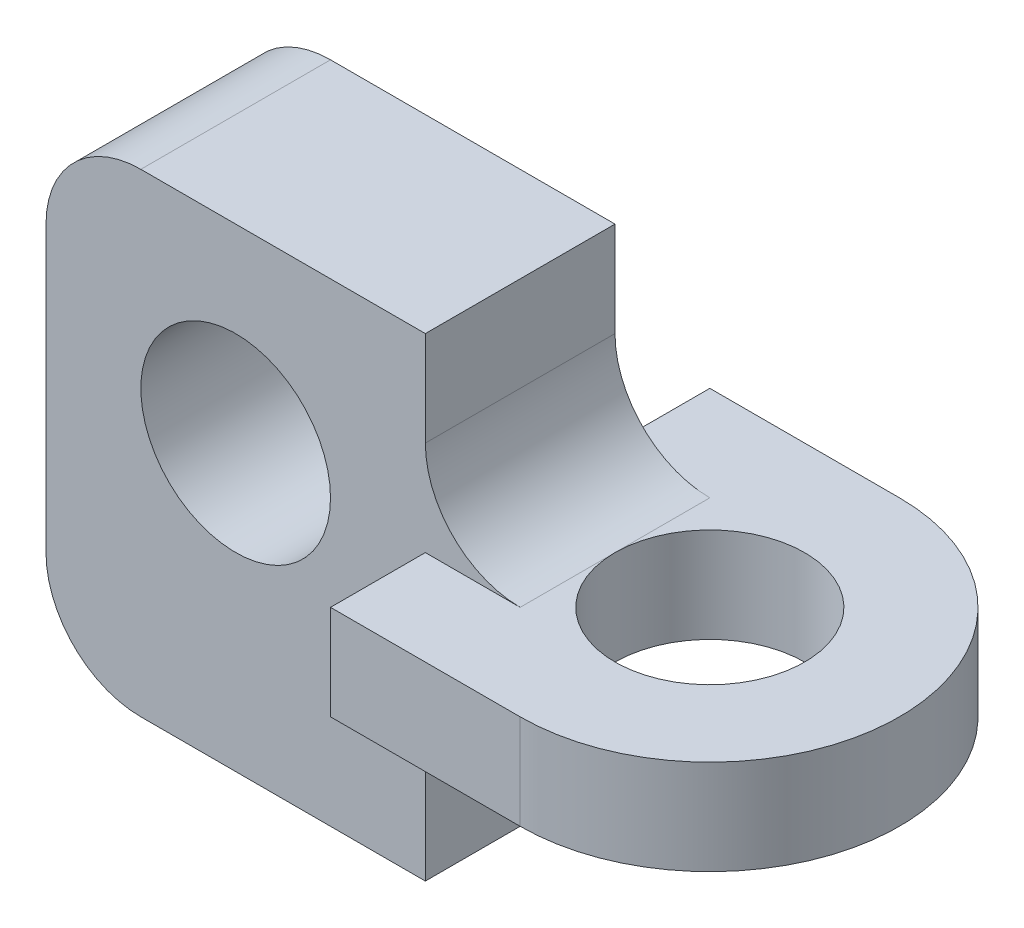
ISO-10303-21;
HEADER;
FILE_DESCRIPTION(('STEP AP214'),'2;1');
FILE_NAME('part.step','',(''),(''),'','','');
FILE_SCHEMA(('AUTOMOTIVE_DESIGN { 1 0 10303 214 1 1 1 1 }'));
ENDSEC;
DATA;
#1=APPLICATION_CONTEXT('core data for automotive mechanical design processes');
#2=APPLICATION_PROTOCOL_DEFINITION('international standard','automotive_design',2000,#1);
#3=PRODUCT_CONTEXT('',#1,'mechanical');
#4=PRODUCT('Part','Part','',(#3));
#5=PRODUCT_RELATED_PRODUCT_CATEGORY('part','',(#4));
#6=PRODUCT_DEFINITION_FORMATION('','',#4);
#7=PRODUCT_DEFINITION_CONTEXT('part definition',#1,'design');
#8=PRODUCT_DEFINITION('design','',#6,#7);
#9=PRODUCT_DEFINITION_SHAPE('','',#8);
#10=(LENGTH_UNIT() NAMED_UNIT(*) SI_UNIT(.MILLI.,.METRE.));
#11=(NAMED_UNIT(*) PLANE_ANGLE_UNIT() SI_UNIT($,.RADIAN.));
#12=(NAMED_UNIT(*) SI_UNIT($,.STERADIAN.) SOLID_ANGLE_UNIT());
#13=UNCERTAINTY_MEASURE_WITH_UNIT(LENGTH_MEASURE(1.E-05),#10,'distance_accuracy_value','');
#14=(GEOMETRIC_REPRESENTATION_CONTEXT(3) GLOBAL_UNCERTAINTY_ASSIGNED_CONTEXT((#13)) GLOBAL_UNIT_ASSIGNED_CONTEXT((#10,
#11,#12)) REPRESENTATION_CONTEXT('',''));
#15=CARTESIAN_POINT('',(0.,0.,0.));
#16=DIRECTION('',(0.,0.,1.));
#17=DIRECTION('',(1.,0.,0.));
#18=AXIS2_PLACEMENT_3D('',#15,#16,#17);
#19=CARTESIAN_POINT('',(-30.,15.,10.));
#20=DIRECTION('',(0.,0.,1.));
#21=DIRECTION('',(1.,0.,0.));
#22=AXIS2_PLACEMENT_3D('',#19,#20,#21);
#23=PLANE('',#22);
#24=DIRECTION('',(-1.,0.,0.));
#25=VECTOR('',#24,1.);
#26=CARTESIAN_POINT('',(-30.,5.,10.));
#27=LINE('',#26,#25);
#28=CARTESIAN_POINT('',(10.,5.,10.));
#29=VERTEX_POINT('',#28);
#30=CARTESIAN_POINT('',(0.,5.,10.));
#31=VERTEX_POINT('',#30);
#32=EDGE_CURVE('E178',#29,#31,#27,.T.);
#33=ORIENTED_EDGE('',*,*,#32,.F.);
#34=CARTESIAN_POINT('',(10.,15.,10.));
#35=DIRECTION('',(0.,0.,1.));
#36=DIRECTION('',(1.,0.,0.));
#37=AXIS2_PLACEMENT_3D('',#34,#35,#36);
#38=CIRCLE('',#37,10.);
#39=CARTESIAN_POINT('',(0.,15.,10.));
#40=VERTEX_POINT('',#39);
#41=EDGE_CURVE('E40',#29,#40,#38,.F.);
#42=ORIENTED_EDGE('',*,*,#41,.T.);
#43=DIRECTION('',(0.,1.,0.));
#44=VECTOR('',#43,1.);
#45=CARTESIAN_POINT('',(0.,25.,10.));
#46=LINE('',#45,#44);
#47=CARTESIAN_POINT('',(0.,25.,10.));
#48=VERTEX_POINT('',#47);
#49=EDGE_CURVE('E210',#40,#48,#46,.T.);
#50=ORIENTED_EDGE('',*,*,#49,.T.);
#51=DIRECTION('',(-1.,0.,0.));
#52=VECTOR('',#51,1.);
#53=CARTESIAN_POINT('',(-29.9999999999999,25.,10.));
#54=LINE('',#53,#52);
#55=CARTESIAN_POINT('',(-29.9999999999999,25.,10.));
#56=VERTEX_POINT('',#55);
#57=EDGE_CURVE('E212',#48,#56,#54,.T.);
#58=ORIENTED_EDGE('',*,*,#57,.T.);
#59=CARTESIAN_POINT('',(-30.,15.,10.));
#60=DIRECTION('',(0.,0.,1.));
#61=DIRECTION('',(1.,0.,0.));
#62=AXIS2_PLACEMENT_3D('',#59,#60,#61);
#63=CIRCLE('',#62,10.);
#64=CARTESIAN_POINT('',(-40.,14.9999999999999,10.));
#65=VERTEX_POINT('',#64);
#66=EDGE_CURVE('E214',#56,#65,#63,.T.);
#67=ORIENTED_EDGE('',*,*,#66,.T.);
#68=DIRECTION('',(0.,-1.,0.));
#69=VECTOR('',#68,1.);
#70=CARTESIAN_POINT('',(-40.,14.9999999999999,10.));
#71=LINE('',#70,#69);
#72=CARTESIAN_POINT('',(-40.,-14.9999999999999,10.));
#73=VERTEX_POINT('',#72);
#74=EDGE_CURVE('E216',#65,#73,#71,.T.);
#75=ORIENTED_EDGE('',*,*,#74,.T.);
#76=CARTESIAN_POINT('',(-30.,-15.,10.));
#77=DIRECTION('',(0.,0.,1.));
#78=DIRECTION('',(1.,0.,0.));
#79=AXIS2_PLACEMENT_3D('',#76,#77,#78);
#80=CIRCLE('',#79,10.);
#81=CARTESIAN_POINT('',(-29.9999999999999,-25.,10.));
#82=VERTEX_POINT('',#81);
#83=EDGE_CURVE('E218',#73,#82,#80,.T.);
#84=ORIENTED_EDGE('',*,*,#83,.T.);
#85=DIRECTION('',(1.,0.,0.));
#86=VECTOR('',#85,1.);
#87=CARTESIAN_POINT('',(-29.9999999999999,-25.,10.));
#88=LINE('',#87,#86);
#89=CARTESIAN_POINT('',(0.,-25.,10.));
#90=VERTEX_POINT('',#89);
#91=EDGE_CURVE('E203',#82,#90,#88,.T.);
#92=ORIENTED_EDGE('',*,*,#91,.T.);
#93=DIRECTION('',(0.,1.,0.));
#94=VECTOR('',#93,1.);
#95=CARTESIAN_POINT('',(0.,-5.,10.));
#96=LINE('',#95,#94);
#97=CARTESIAN_POINT('',(0.,-15.,10.));
#98=VERTEX_POINT('',#97);
#99=EDGE_CURVE('E206',#90,#98,#96,.T.);
#100=ORIENTED_EDGE('',*,*,#99,.T.);
#101=CARTESIAN_POINT('',(10.,-15.,10.));
#102=DIRECTION('',(0.,0.,1.));
#103=DIRECTION('',(1.,0.,0.));
#104=AXIS2_PLACEMENT_3D('',#101,#102,#103);
#105=CIRCLE('',#104,10.);
#106=CARTESIAN_POINT('',(10.,-5.,10.));
#107=VERTEX_POINT('',#106);
#108=EDGE_CURVE('E265',#98,#107,#105,.F.);
#109=ORIENTED_EDGE('',*,*,#108,.T.);
#110=DIRECTION('',(-1.,0.,0.));
#111=VECTOR('',#110,1.);
#112=CARTESIAN_POINT('',(-30.,-5.,10.));
#113=LINE('',#112,#111);
#114=CARTESIAN_POINT('',(0.,-5.,10.));
#115=VERTEX_POINT('',#114);
#116=EDGE_CURVE('E188',#107,#115,#113,.T.);
#117=ORIENTED_EDGE('',*,*,#116,.T.);
#118=DIRECTION('',(0.,1.,0.));
#119=VECTOR('',#118,1.);
#120=CARTESIAN_POINT('',(0.,15.,10.));
#121=LINE('',#120,#119);
#122=EDGE_CURVE('E193',#115,#31,#121,.T.);
#123=ORIENTED_EDGE('',*,*,#122,.T.);
#124=EDGE_LOOP('',(#33,#42,#50,#58,#67,#75,#84,#92,#100,#109,#117,#123));
#125=FACE_BOUND('',#124,.T.);
#126=CARTESIAN_POINT('',(-20.,5.,10.));
#127=DIRECTION('',(0.,0.,1.));
#128=DIRECTION('',(1.,0.,0.));
#129=AXIS2_PLACEMENT_3D('',#126,#127,#128);
#130=CIRCLE('',#129,10.);
#131=CARTESIAN_POINT('',(-9.99999999999999,5.,10.));
#132=VERTEX_POINT('',#131);
#133=EDGE_CURVE('E197',#132,#132,#130,.T.);
#134=ORIENTED_EDGE('',*,*,#133,.F.);
#135=EDGE_LOOP('',(#134));
#136=FACE_BOUND('',#135,.T.);
#137=ADVANCED_FACE('F32',(#125,#136),#23,.T.);
#138=CARTESIAN_POINT('',(-30.,15.,-10.));
#139=DIRECTION('',(0.,0.,1.));
#140=DIRECTION('',(1.,0.,0.));
#141=AXIS2_PLACEMENT_3D('',#138,#139,#140);
#142=PLANE('',#141);
#143=CARTESIAN_POINT('',(10.,15.,-10.));
#144=DIRECTION('',(0.,0.,1.));
#145=DIRECTION('',(1.,0.,0.));
#146=AXIS2_PLACEMENT_3D('',#143,#144,#145);
#147=CIRCLE('',#146,10.);
#148=CARTESIAN_POINT('',(0.,15.,-10.));
#149=VERTEX_POINT('',#148);
#150=CARTESIAN_POINT('',(10.,5.,-10.));
#151=VERTEX_POINT('',#150);
#152=EDGE_CURVE('E54',#149,#151,#147,.T.);
#153=ORIENTED_EDGE('',*,*,#152,.T.);
#154=DIRECTION('',(-1.,0.,0.));
#155=VECTOR('',#154,1.);
#156=CARTESIAN_POINT('',(-30.,5.,-10.));
#157=LINE('',#156,#155);
#158=CARTESIAN_POINT('',(0.,5.,-10.));
#159=VERTEX_POINT('',#158);
#160=EDGE_CURVE('E180',#151,#159,#157,.T.);
#161=ORIENTED_EDGE('',*,*,#160,.T.);
#162=DIRECTION('',(0.,1.,0.));
#163=VECTOR('',#162,1.);
#164=CARTESIAN_POINT('',(0.,15.,-10.));
#165=LINE('',#164,#163);
#166=CARTESIAN_POINT('',(0.,-5.,-10.));
#167=VERTEX_POINT('',#166);
#168=EDGE_CURVE('E11',#167,#159,#165,.T.);
#169=ORIENTED_EDGE('',*,*,#168,.F.);
#170=DIRECTION('',(-1.,0.,0.));
#171=VECTOR('',#170,1.);
#172=CARTESIAN_POINT('',(-30.,-5.,-10.));
#173=LINE('',#172,#171);
#174=CARTESIAN_POINT('',(10.,-5.,-10.));
#175=VERTEX_POINT('',#174);
#176=EDGE_CURVE('E191',#175,#167,#173,.T.);
#177=ORIENTED_EDGE('',*,*,#176,.F.);
#178=CARTESIAN_POINT('',(10.,-15.,-10.));
#179=DIRECTION('',(0.,0.,1.));
#180=DIRECTION('',(1.,0.,0.));
#181=AXIS2_PLACEMENT_3D('',#178,#179,#180);
#182=CIRCLE('',#181,10.);
#183=CARTESIAN_POINT('',(0.,-15.,-10.));
#184=VERTEX_POINT('',#183);
#185=EDGE_CURVE('E263',#175,#184,#182,.T.);
#186=ORIENTED_EDGE('',*,*,#185,.T.);
#187=DIRECTION('',(0.,1.,0.));
#188=VECTOR('',#187,1.);
#189=CARTESIAN_POINT('',(0.,-5.,-10.));
#190=LINE('',#189,#188);
#191=CARTESIAN_POINT('',(0.,-25.,-10.));
#192=VERTEX_POINT('',#191);
#193=EDGE_CURVE('E223',#192,#184,#190,.T.);
#194=ORIENTED_EDGE('',*,*,#193,.F.);
#195=DIRECTION('',(1.,0.,0.));
#196=VECTOR('',#195,1.);
#197=CARTESIAN_POINT('',(-29.9999999999999,-25.,-10.));
#198=LINE('',#197,#196);
#199=CARTESIAN_POINT('',(-29.9999999999999,-25.,-10.));
#200=VERTEX_POINT('',#199);
#201=EDGE_CURVE('E200',#200,#192,#198,.T.);
#202=ORIENTED_EDGE('',*,*,#201,.F.);
#203=CARTESIAN_POINT('',(-30.,-15.,-10.));
#204=DIRECTION('',(0.,0.,1.));
#205=DIRECTION('',(1.,0.,0.));
#206=AXIS2_PLACEMENT_3D('',#203,#204,#205);
#207=CIRCLE('',#206,10.);
#208=CARTESIAN_POINT('',(-40.,-14.9999999999999,-10.));
#209=VERTEX_POINT('',#208);
#210=EDGE_CURVE('E207',#209,#200,#207,.T.);
#211=ORIENTED_EDGE('',*,*,#210,.F.);
#212=DIRECTION('',(0.,-1.,0.));
#213=VECTOR('',#212,1.);
#214=CARTESIAN_POINT('',(-40.,14.9999999999999,-10.));
#215=LINE('',#214,#213);
#216=CARTESIAN_POINT('',(-40.,14.9999999999999,-10.));
#217=VERTEX_POINT('',#216);
#218=EDGE_CURVE('E232',#217,#209,#215,.T.);
#219=ORIENTED_EDGE('',*,*,#218,.F.);
#220=CARTESIAN_POINT('',(-30.,15.,-10.));
#221=DIRECTION('',(0.,0.,1.));
#222=DIRECTION('',(1.,0.,0.));
#223=AXIS2_PLACEMENT_3D('',#220,#221,#222);
#224=CIRCLE('',#223,10.);
#225=CARTESIAN_POINT('',(-29.9999999999999,25.,-10.));
#226=VERTEX_POINT('',#225);
#227=EDGE_CURVE('E230',#226,#217,#224,.T.);
#228=ORIENTED_EDGE('',*,*,#227,.F.);
#229=DIRECTION('',(-1.,0.,0.));
#230=VECTOR('',#229,1.);
#231=CARTESIAN_POINT('',(-29.9999999999999,25.,-10.));
#232=LINE('',#231,#230);
#233=CARTESIAN_POINT('',(0.,25.,-10.));
#234=VERTEX_POINT('',#233);
#235=EDGE_CURVE('E228',#234,#226,#232,.T.);
#236=ORIENTED_EDGE('',*,*,#235,.F.);
#237=DIRECTION('',(0.,1.,0.));
#238=VECTOR('',#237,1.);
#239=CARTESIAN_POINT('',(0.,25.,-10.));
#240=LINE('',#239,#238);
#241=EDGE_CURVE('E226',#149,#234,#240,.T.);
#242=ORIENTED_EDGE('',*,*,#241,.F.);
#243=EDGE_LOOP('',(#153,#161,#169,#177,#186,#194,#202,#211,#219,#228,#236,#242));
#244=FACE_BOUND('',#243,.T.);
#245=CARTESIAN_POINT('',(-20.,5.,-10.));
#246=DIRECTION('',(0.,0.,1.));
#247=DIRECTION('',(1.,0.,0.));
#248=AXIS2_PLACEMENT_3D('',#245,#246,#247);
#249=CIRCLE('',#248,10.);
#250=CARTESIAN_POINT('',(-9.99999999999999,5.,-10.));
#251=VERTEX_POINT('',#250);
#252=EDGE_CURVE('E196',#251,#251,#249,.T.);
#253=ORIENTED_EDGE('',*,*,#252,.T.);
#254=EDGE_LOOP('',(#253));
#255=FACE_BOUND('',#254,.T.);
#256=ADVANCED_FACE('F270',(#244,#255),#142,.F.);
#257=CARTESIAN_POINT('',(-29.9999999999999,-25.,10.));
#258=DIRECTION('',(0.,1.,0.));
#259=DIRECTION('',(0.,0.,1.));
#260=AXIS2_PLACEMENT_3D('',#257,#258,#259);
#261=PLANE('',#260);
#262=ORIENTED_EDGE('',*,*,#201,.T.);
#263=DIRECTION('',(0.,0.,-1.));
#264=VECTOR('',#263,1.);
#265=CARTESIAN_POINT('',(0.,-25.,10.));
#266=LINE('',#265,#264);
#267=EDGE_CURVE('E256',#90,#192,#266,.T.);
#268=ORIENTED_EDGE('',*,*,#267,.F.);
#269=ORIENTED_EDGE('',*,*,#91,.F.);
#270=DIRECTION('',(0.,0.,-1.));
#271=VECTOR('',#270,1.);
#272=CARTESIAN_POINT('',(-29.9999999999999,-25.,10.));
#273=LINE('',#272,#271);
#274=EDGE_CURVE('E220',#82,#200,#273,.T.);
#275=ORIENTED_EDGE('',*,*,#274,.T.);
#276=EDGE_LOOP('',(#262,#268,#269,#275));
#277=FACE_BOUND('',#276,.T.);
#278=ADVANCED_FACE('F334',(#277),#261,.F.);
#279=CARTESIAN_POINT('',(0.,-5.,10.));
#280=DIRECTION('',(-1.,0.,0.));
#281=DIRECTION('',(0.,-1.,0.));
#282=AXIS2_PLACEMENT_3D('',#279,#280,#281);
#283=PLANE('',#282);
#284=ORIENTED_EDGE('',*,*,#193,.T.);
#285=DIRECTION('',(0.,0.,-1.));
#286=VECTOR('',#285,1.);
#287=CARTESIAN_POINT('',(0.,-15.,10.));
#288=LINE('',#287,#286);
#289=EDGE_CURVE('E259',#184,#98,#288,.F.);
#290=ORIENTED_EDGE('',*,*,#289,.T.);
#291=ORIENTED_EDGE('',*,*,#99,.F.);
#292=ORIENTED_EDGE('',*,*,#267,.T.);
#293=EDGE_LOOP('',(#284,#290,#291,#292));
#294=FACE_BOUND('',#293,.T.);
#295=ADVANCED_FACE('F330',(#294),#283,.F.);
#296=CARTESIAN_POINT('',(0.,25.,10.));
#297=DIRECTION('',(-1.,0.,0.));
#298=DIRECTION('',(0.,-1.,0.));
#299=AXIS2_PLACEMENT_3D('',#296,#297,#298);
#300=PLANE('',#299);
#301=ORIENTED_EDGE('',*,*,#49,.F.);
#302=DIRECTION('',(0.,0.,-1.));
#303=VECTOR('',#302,1.);
#304=CARTESIAN_POINT('',(0.,15.,-10.));
#305=LINE('',#304,#303);
#306=EDGE_CURVE('E261',#40,#149,#305,.T.);
#307=ORIENTED_EDGE('',*,*,#306,.T.);
#308=ORIENTED_EDGE('',*,*,#241,.T.);
#309=DIRECTION('',(0.,0.,-1.));
#310=VECTOR('',#309,1.);
#311=CARTESIAN_POINT('',(0.,25.,10.));
#312=LINE('',#311,#310);
#313=EDGE_CURVE('E246',#48,#234,#312,.T.);
#314=ORIENTED_EDGE('',*,*,#313,.F.);
#315=EDGE_LOOP('',(#301,#307,#308,#314));
#316=FACE_BOUND('',#315,.T.);
#317=ADVANCED_FACE('F277',(#316),#300,.F.);
#318=CARTESIAN_POINT('',(-29.9999999999999,25.,10.));
#319=DIRECTION('',(0.,-1.,0.));
#320=DIRECTION('',(0.,0.,-1.));
#321=AXIS2_PLACEMENT_3D('',#318,#319,#320);
#322=PLANE('',#321);
#323=ORIENTED_EDGE('',*,*,#235,.T.);
#324=DIRECTION('',(0.,0.,-1.));
#325=VECTOR('',#324,1.);
#326=CARTESIAN_POINT('',(-29.9999999999999,25.,10.));
#327=LINE('',#326,#325);
#328=EDGE_CURVE('E243',#56,#226,#327,.T.);
#329=ORIENTED_EDGE('',*,*,#328,.F.);
#330=ORIENTED_EDGE('',*,*,#57,.F.);
#331=ORIENTED_EDGE('',*,*,#313,.T.);
#332=EDGE_LOOP('',(#323,#329,#330,#331));
#333=FACE_BOUND('',#332,.T.);
#334=ADVANCED_FACE('F280',(#333),#322,.F.);
#335=CARTESIAN_POINT('',(-30.,15.,10.));
#336=DIRECTION('',(0.,0.,-1.));
#337=DIRECTION('',(-1.,0.,0.));
#338=AXIS2_PLACEMENT_3D('',#335,#336,#337);
#339=CYLINDRICAL_SURFACE('',#338,10.);
#340=ORIENTED_EDGE('',*,*,#227,.T.);
#341=DIRECTION('',(0.,0.,-1.));
#342=VECTOR('',#341,1.);
#343=CARTESIAN_POINT('',(-40.,14.9999999999999,10.));
#344=LINE('',#343,#342);
#345=EDGE_CURVE('E240',#65,#217,#344,.T.);
#346=ORIENTED_EDGE('',*,*,#345,.F.);
#347=ORIENTED_EDGE('',*,*,#66,.F.);
#348=ORIENTED_EDGE('',*,*,#328,.T.);
#349=EDGE_LOOP('',(#340,#346,#347,#348));
#350=FACE_BOUND('',#349,.T.);
#351=ADVANCED_FACE('F346',(#350),#339,.T.);
#352=CARTESIAN_POINT('',(-40.,14.9999999999999,10.));
#353=DIRECTION('',(1.,0.,0.));
#354=DIRECTION('',(0.,1.,0.));
#355=AXIS2_PLACEMENT_3D('',#352,#353,#354);
#356=PLANE('',#355);
#357=ORIENTED_EDGE('',*,*,#218,.T.);
#358=DIRECTION('',(0.,0.,-1.));
#359=VECTOR('',#358,1.);
#360=CARTESIAN_POINT('',(-40.,-14.9999999999999,10.));
#361=LINE('',#360,#359);
#362=EDGE_CURVE('E237',#73,#209,#361,.T.);
#363=ORIENTED_EDGE('',*,*,#362,.F.);
#364=ORIENTED_EDGE('',*,*,#74,.F.);
#365=ORIENTED_EDGE('',*,*,#345,.T.);
#366=EDGE_LOOP('',(#357,#363,#364,#365));
#367=FACE_BOUND('',#366,.T.);
#368=ADVANCED_FACE('F344',(#367),#356,.F.);
#369=CARTESIAN_POINT('',(-30.,-15.,10.));
#370=DIRECTION('',(0.,0.,-1.));
#371=DIRECTION('',(-1.,0.,0.));
#372=AXIS2_PLACEMENT_3D('',#369,#370,#371);
#373=CYLINDRICAL_SURFACE('',#372,10.);
#374=ORIENTED_EDGE('',*,*,#210,.T.);
#375=ORIENTED_EDGE('',*,*,#274,.F.);
#376=ORIENTED_EDGE('',*,*,#83,.F.);
#377=ORIENTED_EDGE('',*,*,#362,.T.);
#378=EDGE_LOOP('',(#374,#375,#376,#377));
#379=FACE_BOUND('',#378,.T.);
#380=ADVANCED_FACE('F339',(#379),#373,.T.);
#381=CARTESIAN_POINT('',(-20.,5.,10.));
#382=DIRECTION('',(0.,0.,-1.));
#383=DIRECTION('',(-1.,0.,0.));
#384=AXIS2_PLACEMENT_3D('',#381,#382,#383);
#385=CYLINDRICAL_SURFACE('',#384,10.);
#386=ORIENTED_EDGE('',*,*,#133,.T.);
#387=EDGE_LOOP('',(#386));
#388=FACE_BOUND('',#387,.T.);
#389=ORIENTED_EDGE('',*,*,#252,.F.);
#390=EDGE_LOOP('',(#389));
#391=FACE_BOUND('',#390,.T.);
#392=ADVANCED_FACE('F362',(#388,#391),#385,.F.);
#393=CARTESIAN_POINT('',(10.,-15.,10.));
#394=DIRECTION('',(0.,0.,1.));
#395=DIRECTION('',(1.,0.,0.));
#396=AXIS2_PLACEMENT_3D('',#393,#394,#395);
#397=CYLINDRICAL_SURFACE('',#396,10.);
#398=ORIENTED_EDGE('',*,*,#108,.F.);
#399=ORIENTED_EDGE('',*,*,#289,.F.);
#400=ORIENTED_EDGE('',*,*,#185,.F.);
#401=DIRECTION('',(0.,0.,-1.));
#402=VECTOR('',#401,1.);
#403=CARTESIAN_POINT('',(10.,-5.,10.));
#404=LINE('',#403,#402);
#405=CARTESIAN_POINT('',(10.,-5.,0.));
#406=VERTEX_POINT('',#405);
#407=EDGE_CURVE('E253',#406,#175,#404,.T.);
#408=ORIENTED_EDGE('',*,*,#407,.F.);
#409=EDGE_CURVE('E254',#107,#406,#404,.T.);
#410=ORIENTED_EDGE('',*,*,#409,.F.);
#411=EDGE_LOOP('',(#398,#399,#400,#408,#410));
#412=FACE_BOUND('',#411,.T.);
#413=ADVANCED_FACE('F326',(#412),#397,.F.);
#414=CARTESIAN_POINT('',(10.,15.,10.));
#415=DIRECTION('',(0.,0.,1.));
#416=DIRECTION('',(1.,0.,0.));
#417=AXIS2_PLACEMENT_3D('',#414,#415,#416);
#418=CYLINDRICAL_SURFACE('',#417,10.);
#419=ORIENTED_EDGE('',*,*,#41,.F.);
#420=DIRECTION('',(0.,0.,-1.));
#421=VECTOR('',#420,1.);
#422=CARTESIAN_POINT('',(10.,5.,10.));
#423=LINE('',#422,#421);
#424=CARTESIAN_POINT('',(10.,5.,0.));
#425=VERTEX_POINT('',#424);
#426=EDGE_CURVE('E250',#29,#425,#423,.T.);
#427=ORIENTED_EDGE('',*,*,#426,.T.);
#428=EDGE_CURVE('E249',#425,#151,#423,.T.);
#429=ORIENTED_EDGE('',*,*,#428,.T.);
#430=ORIENTED_EDGE('',*,*,#152,.F.);
#431=ORIENTED_EDGE('',*,*,#306,.F.);
#432=EDGE_LOOP('',(#419,#427,#429,#430,#431));
#433=FACE_BOUND('',#432,.T.);
#434=ADVANCED_FACE('F34',(#433),#418,.F.);
#435=CARTESIAN_POINT('',(0.,5.,-20.));
#436=DIRECTION('',(1.,0.,0.));
#437=DIRECTION('',(0.,0.,-1.));
#438=AXIS2_PLACEMENT_3D('',#435,#436,#437);
#439=PLANE('',#438);
#440=DIRECTION('',(0.,0.,1.));
#441=VECTOR('',#440,1.);
#442=CARTESIAN_POINT('',(0.,-5.,-20.));
#443=LINE('',#442,#441);
#444=CARTESIAN_POINT('',(0.,-5.,-20.));
#445=VERTEX_POINT('',#444);
#446=EDGE_CURVE('E298',#445,#167,#443,.T.);
#447=ORIENTED_EDGE('',*,*,#446,.T.);
#448=ORIENTED_EDGE('',*,*,#168,.T.);
#449=DIRECTION('',(0.,0.,1.));
#450=VECTOR('',#449,1.);
#451=CARTESIAN_POINT('',(0.,5.,-20.));
#452=LINE('',#451,#450);
#453=CARTESIAN_POINT('',(0.,5.,-20.));
#454=VERTEX_POINT('',#453);
#455=EDGE_CURVE('E309',#454,#159,#452,.T.);
#456=ORIENTED_EDGE('',*,*,#455,.F.);
#457=DIRECTION('',(0.,-1.,0.));
#458=VECTOR('',#457,1.);
#459=CARTESIAN_POINT('',(0.,5.,-20.));
#460=LINE('',#459,#458);
#461=EDGE_CURVE('E159',#454,#445,#460,.T.);
#462=ORIENTED_EDGE('',*,*,#461,.T.);
#463=EDGE_LOOP('',(#447,#448,#456,#462));
#464=FACE_BOUND('',#463,.T.);
#465=ADVANCED_FACE('F379',(#464),#439,.F.);
#466=CARTESIAN_POINT('',(20.,-5.,0.));
#467=DIRECTION('',(0.,1.,0.));
#468=DIRECTION('',(0.,0.,1.));
#469=AXIS2_PLACEMENT_3D('',#466,#467,#468);
#470=PLANE('',#469);
#471=ORIENTED_EDGE('',*,*,#407,.T.);
#472=ORIENTED_EDGE('',*,*,#176,.T.);
#473=ORIENTED_EDGE('',*,*,#446,.F.);
#474=DIRECTION('',(-1.,0.,0.));
#475=VECTOR('',#474,1.);
#476=CARTESIAN_POINT('',(20.,-5.,-20.));
#477=LINE('',#476,#475);
#478=CARTESIAN_POINT('',(20.,-5.,-20.));
#479=VERTEX_POINT('',#478);
#480=EDGE_CURVE('E299',#479,#445,#477,.T.);
#481=ORIENTED_EDGE('',*,*,#480,.F.);
#482=CARTESIAN_POINT('',(20.,-5.,0.));
#483=DIRECTION('',(0.,1.,0.));
#484=DIRECTION('',(0.,0.,1.));
#485=AXIS2_PLACEMENT_3D('',#482,#483,#484);
#486=CIRCLE('',#485,20.);
#487=CARTESIAN_POINT('',(20.,-5.,20.));
#488=VERTEX_POINT('',#487);
#489=EDGE_CURVE('E177',#488,#479,#486,.T.);
#490=ORIENTED_EDGE('',*,*,#489,.F.);
#491=DIRECTION('',(1.,0.,0.));
#492=VECTOR('',#491,1.);
#493=CARTESIAN_POINT('',(0.,-5.,20.));
#494=LINE('',#493,#492);
#495=CARTESIAN_POINT('',(0.,-5.,20.));
#496=VERTEX_POINT('',#495);
#497=EDGE_CURVE('E173',#496,#488,#494,.T.);
#498=ORIENTED_EDGE('',*,*,#497,.F.);
#499=EDGE_CURVE('E293',#115,#496,#443,.T.);
#500=ORIENTED_EDGE('',*,*,#499,.F.);
#501=ORIENTED_EDGE('',*,*,#116,.F.);
#502=ORIENTED_EDGE('',*,*,#409,.T.);
#503=CARTESIAN_POINT('',(20.,-5.,0.));
#504=DIRECTION('',(0.,1.,0.));
#505=DIRECTION('',(0.,0.,1.));
#506=AXIS2_PLACEMENT_3D('',#503,#504,#505);
#507=CIRCLE('',#506,10.);
#508=EDGE_CURVE('E312',#406,#406,#507,.T.);
#509=ORIENTED_EDGE('',*,*,#508,.T.);
#510=EDGE_LOOP('',(#471,#472,#473,#481,#490,#498,#500,#501,#502,#509));
#511=FACE_BOUND('',#510,.T.);
#512=ADVANCED_FACE('F297',(#511),#470,.F.);
#513=CARTESIAN_POINT('',(20.,5.,0.));
#514=DIRECTION('',(0.,1.,0.));
#515=DIRECTION('',(0.,0.,1.));
#516=AXIS2_PLACEMENT_3D('',#513,#514,#515);
#517=PLANE('',#516);
#518=ORIENTED_EDGE('',*,*,#160,.F.);
#519=ORIENTED_EDGE('',*,*,#428,.F.);
#520=CARTESIAN_POINT('',(20.,5.,0.));
#521=DIRECTION('',(0.,1.,0.));
#522=DIRECTION('',(0.,0.,1.));
#523=AXIS2_PLACEMENT_3D('',#520,#521,#522);
#524=CIRCLE('',#523,10.);
#525=EDGE_CURVE('E288',#425,#425,#524,.T.);
#526=ORIENTED_EDGE('',*,*,#525,.F.);
#527=ORIENTED_EDGE('',*,*,#426,.F.);
#528=ORIENTED_EDGE('',*,*,#32,.T.);
#529=CARTESIAN_POINT('',(0.,5.,20.));
#530=VERTEX_POINT('',#529);
#531=EDGE_CURVE('E163',#31,#530,#452,.T.);
#532=ORIENTED_EDGE('',*,*,#531,.T.);
#533=DIRECTION('',(1.,0.,0.));
#534=VECTOR('',#533,1.);
#535=CARTESIAN_POINT('',(0.,5.,20.));
#536=LINE('',#535,#534);
#537=CARTESIAN_POINT('',(20.,5.,20.));
#538=VERTEX_POINT('',#537);
#539=EDGE_CURVE('E169',#530,#538,#536,.T.);
#540=ORIENTED_EDGE('',*,*,#539,.T.);
#541=CARTESIAN_POINT('',(20.,5.,0.));
#542=DIRECTION('',(0.,1.,0.));
#543=DIRECTION('',(0.,0.,1.));
#544=AXIS2_PLACEMENT_3D('',#541,#542,#543);
#545=CIRCLE('',#544,20.);
#546=CARTESIAN_POINT('',(20.,5.,-20.));
#547=VERTEX_POINT('',#546);
#548=EDGE_CURVE('E164',#538,#547,#545,.T.);
#549=ORIENTED_EDGE('',*,*,#548,.T.);
#550=DIRECTION('',(-1.,0.,0.));
#551=VECTOR('',#550,1.);
#552=CARTESIAN_POINT('',(20.,5.,-20.));
#553=LINE('',#552,#551);
#554=EDGE_CURVE('E152',#547,#454,#553,.T.);
#555=ORIENTED_EDGE('',*,*,#554,.T.);
#556=ORIENTED_EDGE('',*,*,#455,.T.);
#557=EDGE_LOOP('',(#518,#519,#526,#527,#528,#532,#540,#549,#555,#556));
#558=FACE_BOUND('',#557,.T.);
#559=ADVANCED_FACE('F167',(#558),#517,.T.);
#560=CARTESIAN_POINT('',(20.,5.,0.));
#561=DIRECTION('',(0.,-1.,0.));
#562=DIRECTION('',(0.,0.,-1.));
#563=AXIS2_PLACEMENT_3D('',#560,#561,#562);
#564=CYLINDRICAL_SURFACE('',#563,20.);
#565=ORIENTED_EDGE('',*,*,#489,.T.);
#566=DIRECTION('',(0.,-1.,0.));
#567=VECTOR('',#566,1.);
#568=CARTESIAN_POINT('',(20.,5.,-20.));
#569=LINE('',#568,#567);
#570=EDGE_CURVE('E156',#547,#479,#569,.T.);
#571=ORIENTED_EDGE('',*,*,#570,.F.);
#572=ORIENTED_EDGE('',*,*,#548,.F.);
#573=DIRECTION('',(0.,-1.,0.));
#574=VECTOR('',#573,1.);
#575=CARTESIAN_POINT('',(20.,5.,20.));
#576=LINE('',#575,#574);
#577=EDGE_CURVE('E306',#538,#488,#576,.T.);
#578=ORIENTED_EDGE('',*,*,#577,.T.);
#579=EDGE_LOOP('',(#565,#571,#572,#578));
#580=FACE_BOUND('',#579,.T.);
#581=ADVANCED_FACE('F175',(#580),#564,.T.);
#582=CARTESIAN_POINT('',(20.,5.,-20.));
#583=DIRECTION('',(0.,0.,1.));
#584=DIRECTION('',(1.,0.,0.));
#585=AXIS2_PLACEMENT_3D('',#582,#583,#584);
#586=PLANE('',#585);
#587=ORIENTED_EDGE('',*,*,#480,.T.);
#588=ORIENTED_EDGE('',*,*,#461,.F.);
#589=ORIENTED_EDGE('',*,*,#554,.F.);
#590=ORIENTED_EDGE('',*,*,#570,.T.);
#591=EDGE_LOOP('',(#587,#588,#589,#590));
#592=FACE_BOUND('',#591,.T.);
#593=ADVANCED_FACE('F154',(#592),#586,.F.);
#594=ORIENTED_EDGE('',*,*,#122,.F.);
#595=ORIENTED_EDGE('',*,*,#499,.T.);
#596=DIRECTION('',(0.,-1.,0.));
#597=VECTOR('',#596,1.);
#598=CARTESIAN_POINT('',(0.,5.,20.));
#599=LINE('',#598,#597);
#600=EDGE_CURVE('E182',#530,#496,#599,.T.);
#601=ORIENTED_EDGE('',*,*,#600,.F.);
#602=ORIENTED_EDGE('',*,*,#531,.F.);
#603=EDGE_LOOP('',(#594,#595,#601,#602));
#604=FACE_BOUND('',#603,.T.);
#605=ADVANCED_FACE('F291',(#604),#439,.F.);
#606=CARTESIAN_POINT('',(0.,5.,20.));
#607=DIRECTION('',(0.,0.,-1.));
#608=DIRECTION('',(-1.,0.,0.));
#609=AXIS2_PLACEMENT_3D('',#606,#607,#608);
#610=PLANE('',#609);
#611=ORIENTED_EDGE('',*,*,#497,.T.);
#612=ORIENTED_EDGE('',*,*,#577,.F.);
#613=ORIENTED_EDGE('',*,*,#539,.F.);
#614=ORIENTED_EDGE('',*,*,#600,.T.);
#615=EDGE_LOOP('',(#611,#612,#613,#614));
#616=FACE_BOUND('',#615,.T.);
#617=ADVANCED_FACE('F308',(#616),#610,.F.);
#618=CARTESIAN_POINT('',(20.,5.,0.));
#619=DIRECTION('',(0.,-1.,0.));
#620=DIRECTION('',(0.,0.,-1.));
#621=AXIS2_PLACEMENT_3D('',#618,#619,#620);
#622=CYLINDRICAL_SURFACE('',#621,10.);
#623=ORIENTED_EDGE('',*,*,#525,.T.);
#624=EDGE_LOOP('',(#623));
#625=FACE_BOUND('',#624,.T.);
#626=ORIENTED_EDGE('',*,*,#508,.F.);
#627=EDGE_LOOP('',(#626));
#628=FACE_BOUND('',#627,.T.);
#629=ADVANCED_FACE('F322',(#625,#628),#622,.F.);
#630=CLOSED_SHELL('',(#137,#256,#278,#295,#317,#334,#351,#368,#380,#392,#413,#434,#465,#512,
#559,#581,#593,#605,#617,#629));
#631=MANIFOLD_SOLID_BREP('B2',#630);
#632=ADVANCED_BREP_SHAPE_REPRESENTATION('',(#18,#631),#14);
#633=SHAPE_DEFINITION_REPRESENTATION(#9,#632);
ENDSEC;
END-ISO-10303-21;
